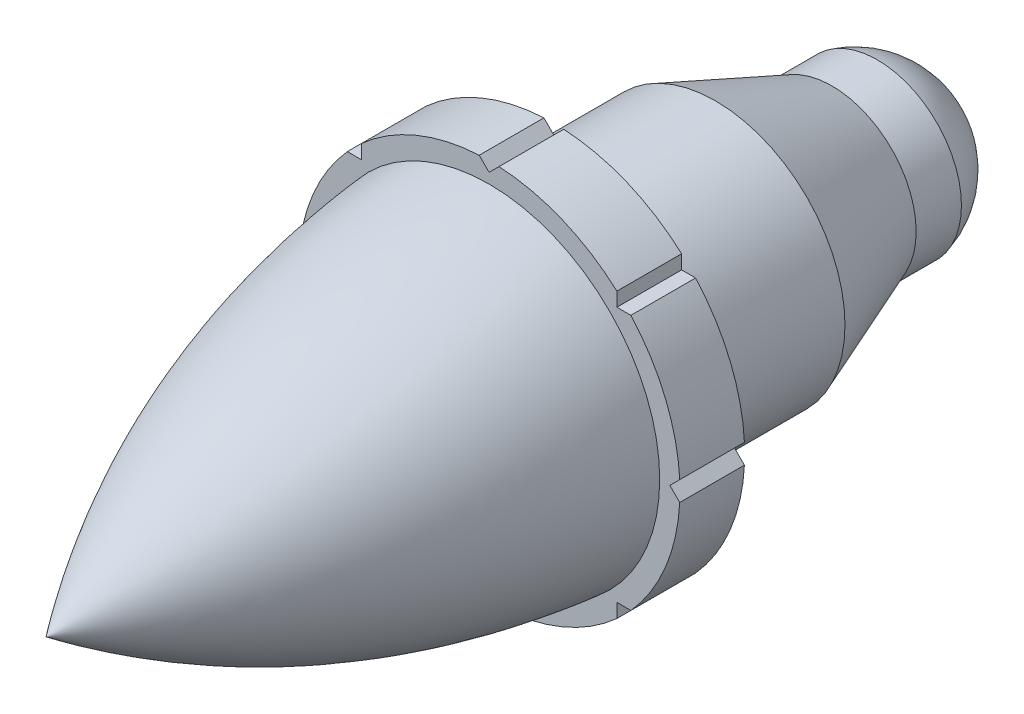
ISO-10303-21;
HEADER;
FILE_DESCRIPTION(('STEP AP214'),'2;1');
FILE_NAME('part.step','',(''),(''),'','','');
FILE_SCHEMA(('AUTOMOTIVE_DESIGN { 1 0 10303 214 1 1 1 1 }'));
ENDSEC;
DATA;
#1=APPLICATION_CONTEXT('core data for automotive mechanical design processes');
#2=APPLICATION_PROTOCOL_DEFINITION('international standard','automotive_design',2000,#1);
#3=PRODUCT_CONTEXT('',#1,'mechanical');
#4=PRODUCT('Part','Part','',(#3));
#5=PRODUCT_RELATED_PRODUCT_CATEGORY('part','',(#4));
#6=PRODUCT_DEFINITION_FORMATION('','',#4);
#7=PRODUCT_DEFINITION_CONTEXT('part definition',#1,'design');
#8=PRODUCT_DEFINITION('design','',#6,#7);
#9=PRODUCT_DEFINITION_SHAPE('','',#8);
#10=(LENGTH_UNIT() NAMED_UNIT(*) SI_UNIT(.MILLI.,.METRE.));
#11=(NAMED_UNIT(*) PLANE_ANGLE_UNIT() SI_UNIT($,.RADIAN.));
#12=(NAMED_UNIT(*) SI_UNIT($,.STERADIAN.) SOLID_ANGLE_UNIT());
#13=UNCERTAINTY_MEASURE_WITH_UNIT(LENGTH_MEASURE(1.E-05),#10,'distance_accuracy_value','');
#14=(GEOMETRIC_REPRESENTATION_CONTEXT(3) GLOBAL_UNCERTAINTY_ASSIGNED_CONTEXT((#13)) GLOBAL_UNIT_ASSIGNED_CONTEXT((#10,
#11,#12)) REPRESENTATION_CONTEXT('',''));
#15=CARTESIAN_POINT('',(0.,0.,0.));
#16=DIRECTION('',(0.,0.,1.));
#17=DIRECTION('',(1.,0.,0.));
#18=AXIS2_PLACEMENT_3D('',#15,#16,#17);
#19=CARTESIAN_POINT('',(0.,6.69709613872832,2.54));
#20=CARTESIAN_POINT('',(0.,5.7889272020502,12.0849471287564));
#21=CARTESIAN_POINT('',(0.,0.,19.9343193526012));
#22=B_SPLINE_CURVE_WITH_KNOTS('',2,(#19,#20,#21),.UNSPECIFIED.,.F.,.F.,(3,3),(0.,1.),.UNSPECIFIED.);
#23=CARTESIAN_POINT('',(0.,0.,-12.7));
#24=DIRECTION('',(0.,0.,-1.));
#25=AXIS1_PLACEMENT('',#23,#24);
#26=SURFACE_OF_REVOLUTION('',#22,#25);
#27=CARTESIAN_POINT('',(0.,0.,19.9343193526012));
#28=VERTEX_POINT('',#27);
#29=VERTEX_LOOP('',#28);
#30=FACE_BOUND('',#29,.T.);
#31=CARTESIAN_POINT('',(0.,0.,2.54));
#32=DIRECTION('',(0.,0.,-1.));
#33=DIRECTION('',(-1.,0.,0.));
#34=AXIS2_PLACEMENT_3D('',#31,#32,#33);
#35=CIRCLE('',#34,6.69709613872832);
#36=CARTESIAN_POINT('',(-6.69709613872832,0.,2.54));
#37=VERTEX_POINT('',#36);
#38=EDGE_CURVE('E13',#37,#37,#35,.T.);
#39=ORIENTED_EDGE('',*,*,#38,.F.);
#40=EDGE_LOOP('',(#39));
#41=FACE_BOUND('',#40,.T.);
#42=ADVANCED_FACE('F49',(#30,#41),#26,.F.);
#43=CARTESIAN_POINT('',(0.,0.,2.68153526011561));
#44=DIRECTION('',(0.,0.,-1.));
#45=DIRECTION('',(-1.,0.,0.));
#46=AXIS2_PLACEMENT_3D('',#43,#44,#45);
#47=CONICAL_SURFACE('',#46,0.,1.5496656470007);
#48=ORIENTED_EDGE('',*,*,#38,.T.);
#49=EDGE_LOOP('',(#48));
#50=FACE_BOUND('',#49,.T.);
#51=CARTESIAN_POINT('',(0.,0.,2.68153526011561));
#52=VERTEX_POINT('',#51);
#53=VERTEX_LOOP('',#52);
#54=FACE_BOUND('',#53,.T.);
#55=ADVANCED_FACE('F63',(#50,#54),#47,.F.);
#56=CLOSED_SHELL('',(#42,#55));
#57=MANIFOLD_SOLID_BREP('B2',#56);
#58=CARTESIAN_POINT('',(0.,0.,11.8860231660232));
#59=DIRECTION('',(0.,0.,1.));
#60=DIRECTION('',(1.,0.,0.));
#61=AXIS2_PLACEMENT_3D('',#58,#59,#60);
#62=CYLINDRICAL_SURFACE('',#61,7.493);
#63=CARTESIAN_POINT('',(0.,0.,2.54));
#64=DIRECTION('',(0.,0.,1.));
#65=DIRECTION('',(1.,0.,0.));
#66=AXIS2_PLACEMENT_3D('',#63,#64,#65);
#67=CIRCLE('',#66,7.493);
#68=CARTESIAN_POINT('',(-7.48295256577662,-0.387904496412491,2.54));
#69=VERTEX_POINT('',#68);
#70=CARTESIAN_POINT('',(-5.56553640242391,-5.01695660269195,2.54));
#71=VERTEX_POINT('',#70);
#72=EDGE_CURVE('E481',#69,#71,#67,.T.);
#73=ORIENTED_EDGE('',*,*,#72,.F.);
#74=DIRECTION('',(0.,0.,1.));
#75=VECTOR('',#74,1.);
#76=CARTESIAN_POINT('',(-7.48295256577662,-0.387904496412491,-15.24));
#77=LINE('',#76,#75);
#78=CARTESIAN_POINT('',(-7.48295256577662,-0.387904496412491,0.));
#79=VERTEX_POINT('',#78);
#80=EDGE_CURVE('E309',#79,#69,#77,.T.);
#81=ORIENTED_EDGE('',*,*,#80,.F.);
#82=CARTESIAN_POINT('',(0.,0.,0.));
#83=DIRECTION('',(0.,0.,1.));
#84=DIRECTION('',(1.,0.,0.));
#85=AXIS2_PLACEMENT_3D('',#82,#83,#84);
#86=CIRCLE('',#85,7.493);
#87=CARTESIAN_POINT('',(-5.56553640242391,-5.01695660269195,0.));
#88=VERTEX_POINT('',#87);
#89=EDGE_CURVE('E459',#79,#88,#86,.T.);
#90=ORIENTED_EDGE('',*,*,#89,.T.);
#91=DIRECTION('',(0.,0.,1.));
#92=VECTOR('',#91,1.);
#93=CARTESIAN_POINT('',(-5.56553640242391,-5.01695660269195,-15.24));
#94=LINE('',#93,#92);
#95=EDGE_CURVE('E323',#88,#71,#94,.T.);
#96=ORIENTED_EDGE('',*,*,#95,.T.);
#97=EDGE_LOOP('',(#73,#81,#90,#96));
#98=FACE_BOUND('',#97,.T.);
#99=ADVANCED_FACE('F91',(#98),#62,.T.);
#100=CARTESIAN_POINT('',(-5.01695660269189,-5.56553640242396,2.54));
#101=VERTEX_POINT('',#100);
#102=CARTESIAN_POINT('',(-0.387904496412464,-7.48295256577662,2.54));
#103=VERTEX_POINT('',#102);
#104=EDGE_CURVE('E482',#101,#103,#67,.T.);
#105=ORIENTED_EDGE('',*,*,#104,.F.);
#106=DIRECTION('',(0.,0.,1.));
#107=VECTOR('',#106,1.);
#108=CARTESIAN_POINT('',(-5.01695660269189,-5.56553640242396,-15.24));
#109=LINE('',#108,#107);
#110=CARTESIAN_POINT('',(-5.01695660269189,-5.56553640242396,0.));
#111=VERTEX_POINT('',#110);
#112=EDGE_CURVE('E329',#111,#101,#109,.T.);
#113=ORIENTED_EDGE('',*,*,#112,.F.);
#114=CARTESIAN_POINT('',(-0.387904496412466,-7.48295256577662,0.));
#115=VERTEX_POINT('',#114);
#116=EDGE_CURVE('E454',#111,#115,#86,.T.);
#117=ORIENTED_EDGE('',*,*,#116,.T.);
#118=DIRECTION('',(0.,0.,1.));
#119=VECTOR('',#118,1.);
#120=CARTESIAN_POINT('',(-0.387904496412464,-7.48295256577662,-15.24));
#121=LINE('',#120,#119);
#122=EDGE_CURVE('E341',#115,#103,#121,.T.);
#123=ORIENTED_EDGE('',*,*,#122,.T.);
#124=EDGE_LOOP('',(#105,#113,#117,#123));
#125=FACE_BOUND('',#124,.T.);
#126=ADVANCED_FACE('F512',(#125),#62,.T.);
#127=CARTESIAN_POINT('',(0.387904496412465,-7.48295256577663,2.54));
#128=VERTEX_POINT('',#127);
#129=CARTESIAN_POINT('',(5.01695660269197,-5.56553640242389,2.54));
#130=VERTEX_POINT('',#129);
#131=EDGE_CURVE('E485',#128,#130,#67,.T.);
#132=ORIENTED_EDGE('',*,*,#131,.F.);
#133=DIRECTION('',(0.,0.,1.));
#134=VECTOR('',#133,1.);
#135=CARTESIAN_POINT('',(0.387904496412465,-7.48295256577663,-15.24));
#136=LINE('',#135,#134);
#137=CARTESIAN_POINT('',(0.387904496412465,-7.48295256577663,0.));
#138=VERTEX_POINT('',#137);
#139=EDGE_CURVE('E347',#138,#128,#136,.T.);
#140=ORIENTED_EDGE('',*,*,#139,.F.);
#141=CARTESIAN_POINT('',(5.01695660269197,-5.56553640242389,0.));
#142=VERTEX_POINT('',#141);
#143=EDGE_CURVE('E449',#138,#142,#86,.T.);
#144=ORIENTED_EDGE('',*,*,#143,.T.);
#145=DIRECTION('',(0.,0.,1.));
#146=VECTOR('',#145,1.);
#147=CARTESIAN_POINT('',(5.01695660269197,-5.56553640242389,-15.24));
#148=LINE('',#147,#146);
#149=EDGE_CURVE('E357',#142,#130,#148,.T.);
#150=ORIENTED_EDGE('',*,*,#149,.T.);
#151=EDGE_LOOP('',(#132,#140,#144,#150));
#152=FACE_BOUND('',#151,.T.);
#153=ADVANCED_FACE('F518',(#152),#62,.T.);
#154=CARTESIAN_POINT('',(5.56553640242398,-5.01695660269187,2.54));
#155=VERTEX_POINT('',#154);
#156=CARTESIAN_POINT('',(7.48295256577663,-0.387904496412386,2.54));
#157=VERTEX_POINT('',#156);
#158=EDGE_CURVE('E275',#155,#157,#67,.T.);
#159=ORIENTED_EDGE('',*,*,#158,.F.);
#160=DIRECTION('',(0.,0.,1.));
#161=VECTOR('',#160,1.);
#162=CARTESIAN_POINT('',(5.56553640242398,-5.01695660269187,-15.24));
#163=LINE('',#162,#161);
#164=CARTESIAN_POINT('',(5.56553640242398,-5.01695660269187,0.));
#165=VERTEX_POINT('',#164);
#166=EDGE_CURVE('E363',#165,#155,#163,.T.);
#167=ORIENTED_EDGE('',*,*,#166,.F.);
#168=CARTESIAN_POINT('',(7.48295256577663,-0.387904496412387,0.));
#169=VERTEX_POINT('',#168);
#170=EDGE_CURVE('E445',#165,#169,#86,.T.);
#171=ORIENTED_EDGE('',*,*,#170,.T.);
#172=DIRECTION('',(0.,0.,1.));
#173=VECTOR('',#172,1.);
#174=CARTESIAN_POINT('',(7.48295256577663,-0.387904496412386,-15.24));
#175=LINE('',#174,#173);
#176=EDGE_CURVE('E114',#169,#157,#175,.T.);
#177=ORIENTED_EDGE('',*,*,#176,.T.);
#178=EDGE_LOOP('',(#159,#167,#171,#177));
#179=FACE_BOUND('',#178,.T.);
#180=ADVANCED_FACE('F534',(#179),#62,.T.);
#181=CARTESIAN_POINT('',(7.48295256577662,0.387904496412543,2.54));
#182=VERTEX_POINT('',#181);
#183=CARTESIAN_POINT('',(5.56553640242387,5.01695660269199,2.54));
#184=VERTEX_POINT('',#183);
#185=EDGE_CURVE('E493',#182,#184,#67,.T.);
#186=ORIENTED_EDGE('',*,*,#185,.F.);
#187=DIRECTION('',(0.,0.,1.));
#188=VECTOR('',#187,1.);
#189=CARTESIAN_POINT('',(7.48295256577662,0.387904496412543,-15.24));
#190=LINE('',#189,#188);
#191=CARTESIAN_POINT('',(7.48295256577662,0.387904496412543,0.));
#192=VERTEX_POINT('',#191);
#193=EDGE_CURVE('E264',#192,#182,#190,.T.);
#194=ORIENTED_EDGE('',*,*,#193,.F.);
#195=CARTESIAN_POINT('',(5.56553640242387,5.01695660269199,0.));
#196=VERTEX_POINT('',#195);
#197=EDGE_CURVE('E443',#192,#196,#86,.T.);
#198=ORIENTED_EDGE('',*,*,#197,.T.);
#199=DIRECTION('',(0.,0.,1.));
#200=VECTOR('',#199,1.);
#201=CARTESIAN_POINT('',(5.56553640242387,5.01695660269199,-15.24));
#202=LINE('',#201,#200);
#203=EDGE_CURVE('E106',#196,#184,#202,.T.);
#204=ORIENTED_EDGE('',*,*,#203,.T.);
#205=EDGE_LOOP('',(#186,#194,#198,#204));
#206=FACE_BOUND('',#205,.T.);
#207=ADVANCED_FACE('F495',(#206),#62,.T.);
#208=CARTESIAN_POINT('',(5.01695660269185,5.56553640242399,2.54));
#209=VERTEX_POINT('',#208);
#210=CARTESIAN_POINT('',(0.387904496412464,7.48295256577662,2.54));
#211=VERTEX_POINT('',#210);
#212=EDGE_CURVE('E414',#209,#211,#67,.T.);
#213=ORIENTED_EDGE('',*,*,#212,.F.);
#214=DIRECTION('',(0.,0.,1.));
#215=VECTOR('',#214,1.);
#216=CARTESIAN_POINT('',(5.01695660269185,5.56553640242399,-15.24));
#217=LINE('',#216,#215);
#218=CARTESIAN_POINT('',(5.01695660269185,5.56553640242399,0.));
#219=VERTEX_POINT('',#218);
#220=EDGE_CURVE('E294',#219,#209,#217,.T.);
#221=ORIENTED_EDGE('',*,*,#220,.F.);
#222=CARTESIAN_POINT('',(0.387904496412465,7.48295256577663,0.));
#223=VERTEX_POINT('',#222);
#224=EDGE_CURVE('E410',#219,#223,#86,.T.);
#225=ORIENTED_EDGE('',*,*,#224,.T.);
#226=DIRECTION('',(0.,0.,1.));
#227=VECTOR('',#226,1.);
#228=CARTESIAN_POINT('',(0.387904496412464,7.48295256577662,-15.24));
#229=LINE('',#228,#227);
#230=EDGE_CURVE('E397',#223,#211,#229,.T.);
#231=ORIENTED_EDGE('',*,*,#230,.T.);
#232=EDGE_LOOP('',(#213,#221,#225,#231));
#233=FACE_BOUND('',#232,.T.);
#234=ADVANCED_FACE('F441',(#233),#62,.T.);
#235=CARTESIAN_POINT('',(-5.56553640242394,5.01695660269191,0.));
#236=VERTEX_POINT('',#235);
#237=CARTESIAN_POINT('',(-7.48295256577663,0.38790449641244,0.));
#238=VERTEX_POINT('',#237);
#239=EDGE_CURVE('E415',#236,#238,#86,.T.);
#240=ORIENTED_EDGE('',*,*,#239,.T.);
#241=DIRECTION('',(0.,0.,1.));
#242=VECTOR('',#241,1.);
#243=CARTESIAN_POINT('',(-7.48295256577663,0.387904496412438,-15.24));
#244=LINE('',#243,#242);
#245=CARTESIAN_POINT('',(-7.48295256577663,0.387904496412438,2.54));
#246=VERTEX_POINT('',#245);
#247=EDGE_CURVE('E303',#238,#246,#244,.T.);
#248=ORIENTED_EDGE('',*,*,#247,.T.);
#249=CARTESIAN_POINT('',(-5.56553640242394,5.01695660269191,2.54));
#250=VERTEX_POINT('',#249);
#251=EDGE_CURVE('E419',#250,#246,#67,.T.);
#252=ORIENTED_EDGE('',*,*,#251,.F.);
#253=DIRECTION('',(0.,0.,1.));
#254=VECTOR('',#253,1.);
#255=CARTESIAN_POINT('',(-5.56553640242394,5.01695660269191,-15.24));
#256=LINE('',#255,#254);
#257=EDGE_CURVE('E379',#236,#250,#256,.T.);
#258=ORIENTED_EDGE('',*,*,#257,.F.);
#259=EDGE_LOOP('',(#240,#248,#252,#258));
#260=FACE_BOUND('',#259,.T.);
#261=ADVANCED_FACE('F470',(#260),#62,.T.);
#262=CARTESIAN_POINT('',(0.,0.,2.54));
#263=DIRECTION('',(0.,0.,-1.));
#264=DIRECTION('',(-1.,0.,0.));
#265=AXIS2_PLACEMENT_3D('',#262,#263,#264);
#266=PLANE('',#265);
#267=DIRECTION('',(-0.70710678118655,0.707106781186545,0.));
#268=VECTOR('',#267,1.);
#269=CARTESIAN_POINT('',(-7.09504806936416,0.,2.54));
#270=LINE('',#269,#268);
#271=CARTESIAN_POINT('',(-7.09504806936416,0.,2.54));
#272=VERTEX_POINT('',#271);
#273=EDGE_CURVE('E298',#272,#246,#270,.T.);
#274=ORIENTED_EDGE('',*,*,#273,.F.);
#275=DIRECTION('',(0.707106781186545,0.70710678118655,0.));
#276=VECTOR('',#275,1.);
#277=CARTESIAN_POINT('',(-7.09504806936416,0.,2.54));
#278=LINE('',#277,#276);
#279=EDGE_CURVE('E311',#69,#272,#278,.T.);
#280=ORIENTED_EDGE('',*,*,#279,.F.);
#281=ORIENTED_EDGE('',*,*,#72,.T.);
#282=DIRECTION('',(-1.,0.,0.));
#283=VECTOR('',#282,1.);
#284=CARTESIAN_POINT('',(-5.01695660269189,-5.01695660269195,2.54));
#285=LINE('',#284,#283);
#286=CARTESIAN_POINT('',(-5.01695660269189,-5.01695660269195,2.54));
#287=VERTEX_POINT('',#286);
#288=EDGE_CURVE('E318',#287,#71,#285,.T.);
#289=ORIENTED_EDGE('',*,*,#288,.F.);
#290=DIRECTION('',(0.,1.,0.));
#291=VECTOR('',#290,1.);
#292=CARTESIAN_POINT('',(-5.01695660269189,-5.01695660269195,2.54));
#293=LINE('',#292,#291);
#294=EDGE_CURVE('E331',#101,#287,#293,.T.);
#295=ORIENTED_EDGE('',*,*,#294,.F.);
#296=ORIENTED_EDGE('',*,*,#104,.T.);
#297=DIRECTION('',(-0.707106781186548,-0.707106781186547,0.));
#298=VECTOR('',#297,1.);
#299=CARTESIAN_POINT('',(0.,-7.09504806936416,2.54));
#300=LINE('',#299,#298);
#301=CARTESIAN_POINT('',(0.,-7.09504806936416,2.54));
#302=VERTEX_POINT('',#301);
#303=EDGE_CURVE('E336',#302,#103,#300,.T.);
#304=ORIENTED_EDGE('',*,*,#303,.F.);
#305=DIRECTION('',(-0.707106781186548,0.707106781186547,0.));
#306=VECTOR('',#305,1.);
#307=CARTESIAN_POINT('',(0.,-7.09504806936416,2.54));
#308=LINE('',#307,#306);
#309=EDGE_CURVE('E349',#128,#302,#308,.T.);
#310=ORIENTED_EDGE('',*,*,#309,.F.);
#311=ORIENTED_EDGE('',*,*,#131,.T.);
#312=DIRECTION('',(0.,-1.,0.));
#313=VECTOR('',#312,1.);
#314=CARTESIAN_POINT('',(5.01695660269196,-5.01695660269188,2.54));
#315=LINE('',#314,#313);
#316=CARTESIAN_POINT('',(5.01695660269196,-5.01695660269188,2.54));
#317=VERTEX_POINT('',#316);
#318=EDGE_CURVE('E286',#317,#130,#315,.T.);
#319=ORIENTED_EDGE('',*,*,#318,.F.);
#320=DIRECTION('',(-1.,0.,0.));
#321=VECTOR('',#320,1.);
#322=CARTESIAN_POINT('',(5.01695660269196,-5.01695660269188,2.54));
#323=LINE('',#322,#321);
#324=EDGE_CURVE('E365',#155,#317,#323,.T.);
#325=ORIENTED_EDGE('',*,*,#324,.F.);
#326=ORIENTED_EDGE('',*,*,#158,.T.);
#327=DIRECTION('',(0.707106781186555,-0.70710678118654,0.));
#328=VECTOR('',#327,1.);
#329=CARTESIAN_POINT('',(7.09504806936416,0.,2.54));
#330=LINE('',#329,#328);
#331=CARTESIAN_POINT('',(7.09504806936416,0.,2.54));
#332=VERTEX_POINT('',#331);
#333=EDGE_CURVE('E255',#332,#157,#330,.T.);
#334=ORIENTED_EDGE('',*,*,#333,.F.);
#335=DIRECTION('',(-0.70710678118654,-0.707106781186555,0.));
#336=VECTOR('',#335,1.);
#337=CARTESIAN_POINT('',(7.09504806936416,0.,2.54));
#338=LINE('',#337,#336);
#339=EDGE_CURVE('E261',#182,#332,#338,.T.);
#340=ORIENTED_EDGE('',*,*,#339,.F.);
#341=ORIENTED_EDGE('',*,*,#185,.T.);
#342=DIRECTION('',(1.,0.,0.));
#343=VECTOR('',#342,1.);
#344=CARTESIAN_POINT('',(5.01695660269186,5.01695660269198,2.54));
#345=LINE('',#344,#343);
#346=CARTESIAN_POINT('',(5.01695660269186,5.01695660269198,2.54));
#347=VERTEX_POINT('',#346);
#348=EDGE_CURVE('E287',#347,#184,#345,.T.);
#349=ORIENTED_EDGE('',*,*,#348,.F.);
#350=DIRECTION('',(0.,-1.,0.));
#351=VECTOR('',#350,1.);
#352=CARTESIAN_POINT('',(5.01695660269186,5.01695660269198,2.54));
#353=LINE('',#352,#351);
#354=EDGE_CURVE('E279',#209,#347,#353,.T.);
#355=ORIENTED_EDGE('',*,*,#354,.F.);
#356=ORIENTED_EDGE('',*,*,#212,.T.);
#357=DIRECTION('',(0.707106781186548,0.707106781186547,0.));
#358=VECTOR('',#357,1.);
#359=CARTESIAN_POINT('',(0.,7.09504806936416,2.54));
#360=LINE('',#359,#358);
#361=CARTESIAN_POINT('',(0.,7.09504806936416,2.54));
#362=VERTEX_POINT('',#361);
#363=EDGE_CURVE('E390',#362,#211,#360,.T.);
#364=ORIENTED_EDGE('',*,*,#363,.F.);
#365=DIRECTION('',(0.707106781186548,-0.707106781186547,0.));
#366=VECTOR('',#365,1.);
#367=CARTESIAN_POINT('',(0.,7.09504806936416,2.54));
#368=LINE('',#367,#366);
#369=CARTESIAN_POINT('',(-0.387904496412465,7.48295256577663,2.54));
#370=VERTEX_POINT('',#369);
#371=EDGE_CURVE('E387',#370,#362,#368,.T.);
#372=ORIENTED_EDGE('',*,*,#371,.F.);
#373=CARTESIAN_POINT('',(-5.01695660269193,5.56553640242392,2.54));
#374=VERTEX_POINT('',#373);
#375=EDGE_CURVE('E416',#370,#374,#67,.T.);
#376=ORIENTED_EDGE('',*,*,#375,.T.);
#377=DIRECTION('',(0.,1.,0.));
#378=VECTOR('',#377,1.);
#379=CARTESIAN_POINT('',(-5.01695660269193,5.01695660269191,2.54));
#380=LINE('',#379,#378);
#381=CARTESIAN_POINT('',(-5.01695660269193,5.01695660269191,2.54));
#382=VERTEX_POINT('',#381);
#383=EDGE_CURVE('E317',#382,#374,#380,.T.);
#384=ORIENTED_EDGE('',*,*,#383,.F.);
#385=DIRECTION('',(1.,0.,0.));
#386=VECTOR('',#385,1.);
#387=CARTESIAN_POINT('',(-5.01695660269193,5.01695660269191,2.54));
#388=LINE('',#387,#386);
#389=EDGE_CURVE('E381',#250,#382,#388,.T.);
#390=ORIENTED_EDGE('',*,*,#389,.F.);
#391=ORIENTED_EDGE('',*,*,#251,.T.);
#392=EDGE_LOOP('',(#274,#280,#281,#289,#295,#296,#304,#310,#311,#319,#325,#326,#334,#340,#341,
#349,#355,#356,#364,#372,#376,#384,#390,#391));
#393=FACE_BOUND('',#392,.T.);
#394=ADVANCED_FACE('F272',(#393),#266,.F.);
#395=CARTESIAN_POINT('',(-0.387904496412465,7.48295256577663,0.));
#396=VERTEX_POINT('',#395);
#397=CARTESIAN_POINT('',(-5.01695660269193,5.56553640242393,0.));
#398=VERTEX_POINT('',#397);
#399=EDGE_CURVE('E411',#396,#398,#86,.T.);
#400=ORIENTED_EDGE('',*,*,#399,.T.);
#401=DIRECTION('',(0.,0.,1.));
#402=VECTOR('',#401,1.);
#403=CARTESIAN_POINT('',(-5.01695660269193,5.56553640242392,-15.24));
#404=LINE('',#403,#402);
#405=EDGE_CURVE('E373',#398,#374,#404,.T.);
#406=ORIENTED_EDGE('',*,*,#405,.T.);
#407=ORIENTED_EDGE('',*,*,#375,.F.);
#408=DIRECTION('',(0.,0.,1.));
#409=VECTOR('',#408,1.);
#410=CARTESIAN_POINT('',(-0.387904496412465,7.48295256577663,-15.24));
#411=LINE('',#410,#409);
#412=EDGE_CURVE('E394',#396,#370,#411,.T.);
#413=ORIENTED_EDGE('',*,*,#412,.F.);
#414=EDGE_LOOP('',(#400,#406,#407,#413));
#415=FACE_BOUND('',#414,.T.);
#416=ADVANCED_FACE('F514',(#415),#62,.T.);
#417=CARTESIAN_POINT('',(0.,7.493,0.));
#418=DIRECTION('',(0.,0.,1.));
#419=DIRECTION('',(1.,0.,0.));
#420=AXIS2_PLACEMENT_3D('',#417,#418,#419);
#421=PLANE('',#420);
#422=ORIENTED_EDGE('',*,*,#89,.F.);
#423=DIRECTION('',(0.707106781186545,0.70710678118655,0.));
#424=VECTOR('',#423,1.);
#425=CARTESIAN_POINT('',(-7.29402403468208,-0.198975965317945,0.));
#426=LINE('',#425,#424);
#427=CARTESIAN_POINT('',(-7.09504806936416,0.,0.));
#428=VERTEX_POINT('',#427);
#429=EDGE_CURVE('E314',#79,#428,#426,.T.);
#430=ORIENTED_EDGE('',*,*,#429,.T.);
#431=DIRECTION('',(-0.70710678118655,0.707106781186545,0.));
#432=VECTOR('',#431,1.);
#433=CARTESIAN_POINT('',(-7.29402403468208,0.198975965317894,0.));
#434=LINE('',#433,#432);
#435=EDGE_CURVE('E306',#428,#238,#434,.T.);
#436=ORIENTED_EDGE('',*,*,#435,.T.);
#437=ORIENTED_EDGE('',*,*,#239,.F.);
#438=DIRECTION('',(1.,0.,0.));
#439=VECTOR('',#438,1.);
#440=CARTESIAN_POINT('',(-5.29835111143081,5.01695660269191,0.));
#441=LINE('',#440,#439);
#442=CARTESIAN_POINT('',(-5.01695660269193,5.01695660269191,0.));
#443=VERTEX_POINT('',#442);
#444=EDGE_CURVE('E384',#236,#443,#441,.T.);
#445=ORIENTED_EDGE('',*,*,#444,.T.);
#446=DIRECTION('',(0.,1.,0.));
#447=VECTOR('',#446,1.);
#448=CARTESIAN_POINT('',(-5.01695660269193,5.29835111143079,0.));
#449=LINE('',#448,#447);
#450=EDGE_CURVE('E376',#443,#398,#449,.T.);
#451=ORIENTED_EDGE('',*,*,#450,.T.);
#452=ORIENTED_EDGE('',*,*,#399,.F.);
#453=DIRECTION('',(0.707106781186548,-0.707106781186547,0.));
#454=VECTOR('',#453,1.);
#455=CARTESIAN_POINT('',(-0.198975965317919,7.29402403468208,0.));
#456=LINE('',#455,#454);
#457=CARTESIAN_POINT('',(0.,7.09504806936416,0.));
#458=VERTEX_POINT('',#457);
#459=EDGE_CURVE('E47',#396,#458,#456,.T.);
#460=ORIENTED_EDGE('',*,*,#459,.T.);
#461=DIRECTION('',(0.707106781186548,0.707106781186547,0.));
#462=VECTOR('',#461,1.);
#463=CARTESIAN_POINT('',(0.198975965317919,7.29402403468208,0.));
#464=LINE('',#463,#462);
#465=EDGE_CURVE('E99',#458,#223,#464,.T.);
#466=ORIENTED_EDGE('',*,*,#465,.T.);
#467=ORIENTED_EDGE('',*,*,#224,.F.);
#468=DIRECTION('',(0.,-1.,0.));
#469=VECTOR('',#468,1.);
#470=CARTESIAN_POINT('',(5.01695660269186,5.29835111143086,0.));
#471=LINE('',#470,#469);
#472=CARTESIAN_POINT('',(5.01695660269186,5.01695660269198,0.));
#473=VERTEX_POINT('',#472);
#474=EDGE_CURVE('E276',#219,#473,#471,.T.);
#475=ORIENTED_EDGE('',*,*,#474,.T.);
#476=DIRECTION('',(1.,0.,0.));
#477=VECTOR('',#476,1.);
#478=CARTESIAN_POINT('',(5.29835111143074,5.01695660269198,0.));
#479=LINE('',#478,#477);
#480=EDGE_CURVE('E292',#473,#196,#479,.T.);
#481=ORIENTED_EDGE('',*,*,#480,.T.);
#482=ORIENTED_EDGE('',*,*,#197,.F.);
#483=DIRECTION('',(-0.70710678118654,-0.707106781186555,0.));
#484=VECTOR('',#483,1.);
#485=CARTESIAN_POINT('',(7.29402403468208,0.198975965317996,0.));
#486=LINE('',#485,#484);
#487=CARTESIAN_POINT('',(7.09504806936416,0.,0.));
#488=VERTEX_POINT('',#487);
#489=EDGE_CURVE('E268',#192,#488,#486,.T.);
#490=ORIENTED_EDGE('',*,*,#489,.T.);
#491=DIRECTION('',(0.707106781186555,-0.70710678118654,0.));
#492=VECTOR('',#491,1.);
#493=CARTESIAN_POINT('',(7.29402403468208,-0.198975965317843,0.));
#494=LINE('',#493,#492);
#495=EDGE_CURVE('E256',#488,#169,#494,.T.);
#496=ORIENTED_EDGE('',*,*,#495,.T.);
#497=ORIENTED_EDGE('',*,*,#170,.F.);
#498=DIRECTION('',(-1.,0.,0.));
#499=VECTOR('',#498,1.);
#500=CARTESIAN_POINT('',(5.29835111143084,-5.01695660269187,0.));
#501=LINE('',#500,#499);
#502=CARTESIAN_POINT('',(5.01695660269196,-5.01695660269188,0.));
#503=VERTEX_POINT('',#502);
#504=EDGE_CURVE('E339',#165,#503,#501,.T.);
#505=ORIENTED_EDGE('',*,*,#504,.T.);
#506=DIRECTION('',(0.,-1.,0.));
#507=VECTOR('',#506,1.);
#508=CARTESIAN_POINT('',(5.01695660269197,-5.29835111143076,0.));
#509=LINE('',#508,#507);
#510=EDGE_CURVE('E360',#503,#142,#509,.T.);
#511=ORIENTED_EDGE('',*,*,#510,.T.);
#512=ORIENTED_EDGE('',*,*,#143,.F.);
#513=DIRECTION('',(-0.707106781186548,0.707106781186547,0.));
#514=VECTOR('',#513,1.);
#515=CARTESIAN_POINT('',(0.198975965317919,-7.29402403468208,0.));
#516=LINE('',#515,#514);
#517=CARTESIAN_POINT('',(0.,-7.09504806936416,0.));
#518=VERTEX_POINT('',#517);
#519=EDGE_CURVE('E321',#138,#518,#516,.T.);
#520=ORIENTED_EDGE('',*,*,#519,.T.);
#521=DIRECTION('',(-0.707106781186548,-0.707106781186547,0.));
#522=VECTOR('',#521,1.);
#523=CARTESIAN_POINT('',(-0.198975965317919,-7.29402403468208,0.));
#524=LINE('',#523,#522);
#525=EDGE_CURVE('E344',#518,#115,#524,.T.);
#526=ORIENTED_EDGE('',*,*,#525,.T.);
#527=ORIENTED_EDGE('',*,*,#116,.F.);
#528=DIRECTION('',(0.,1.,0.));
#529=VECTOR('',#528,1.);
#530=CARTESIAN_POINT('',(-5.01695660269189,-5.29835111143083,0.));
#531=LINE('',#530,#529);
#532=CARTESIAN_POINT('',(-5.01695660269189,-5.01695660269195,0.));
#533=VERTEX_POINT('',#532);
#534=EDGE_CURVE('E301',#111,#533,#531,.T.);
#535=ORIENTED_EDGE('',*,*,#534,.T.);
#536=DIRECTION('',(-1.,0.,0.));
#537=VECTOR('',#536,1.);
#538=CARTESIAN_POINT('',(-5.29835111143077,-5.01695660269195,0.));
#539=LINE('',#538,#537);
#540=EDGE_CURVE('E326',#533,#88,#539,.T.);
#541=ORIENTED_EDGE('',*,*,#540,.T.);
#542=EDGE_LOOP('',(#422,#430,#436,#437,#445,#451,#452,#460,#466,#467,#475,#481,#482,#490,#496,
#497,#505,#511,#512,#520,#526,#527,#535,#541));
#543=FACE_BOUND('',#542,.T.);
#544=CARTESIAN_POINT('',(0.,0.,0.));
#545=DIRECTION('',(0.,0.,1.));
#546=DIRECTION('',(1.,0.,0.));
#547=AXIS2_PLACEMENT_3D('',#544,#545,#546);
#548=CIRCLE('',#547,5.08);
#549=CARTESIAN_POINT('',(5.08,0.,0.));
#550=VERTEX_POINT('',#549);
#551=EDGE_CURVE('E407',#550,#550,#548,.T.);
#552=ORIENTED_EDGE('',*,*,#551,.T.);
#553=EDGE_LOOP('',(#552));
#554=FACE_BOUND('',#553,.T.);
#555=ADVANCED_FACE('F425',(#543,#554),#421,.F.);
#556=CARTESIAN_POINT('',(0.,0.,11.8860231660232));
#557=DIRECTION('',(0.,0.,1.));
#558=DIRECTION('',(1.,0.,0.));
#559=AXIS2_PLACEMENT_3D('',#556,#557,#558);
#560=CYLINDRICAL_SURFACE('',#559,5.08);
#561=CARTESIAN_POINT('',(0.,0.,-6.35));
#562=DIRECTION('',(0.,0.,1.));
#563=DIRECTION('',(1.,0.,0.));
#564=AXIS2_PLACEMENT_3D('',#561,#562,#563);
#565=CIRCLE('',#564,5.08);
#566=CARTESIAN_POINT('',(5.08,0.,-6.35));
#567=VERTEX_POINT('',#566);
#568=EDGE_CURVE('E401',#567,#567,#565,.T.);
#569=ORIENTED_EDGE('',*,*,#568,.T.);
#570=EDGE_LOOP('',(#569));
#571=FACE_BOUND('',#570,.T.);
#572=ORIENTED_EDGE('',*,*,#551,.F.);
#573=EDGE_LOOP('',(#572));
#574=FACE_BOUND('',#573,.T.);
#575=ADVANCED_FACE('F526',(#571,#574),#560,.T.);
#576=CARTESIAN_POINT('',(0.,0.,23.0525574340242));
#577=DIRECTION('',(0.,0.,1.));
#578=DIRECTION('',(1.,0.,0.));
#579=AXIS2_PLACEMENT_3D('',#576,#577,#578);
#580=CYLINDRICAL_SURFACE('',#579,3.302);
#581=CARTESIAN_POINT('',(0.,0.,-12.7));
#582=DIRECTION('',(0.,0.,1.));
#583=DIRECTION('',(1.,0.,0.));
#584=AXIS2_PLACEMENT_3D('',#581,#582,#583);
#585=CIRCLE('',#584,3.302);
#586=CARTESIAN_POINT('',(3.302,0.,-12.7));
#587=VERTEX_POINT('',#586);
#588=EDGE_CURVE('E396',#587,#587,#585,.T.);
#589=ORIENTED_EDGE('',*,*,#588,.T.);
#590=EDGE_LOOP('',(#589));
#591=FACE_BOUND('',#590,.T.);
#592=CARTESIAN_POINT('',(0.,0.,-10.922));
#593=DIRECTION('',(0.,0.,1.));
#594=DIRECTION('',(1.,0.,0.));
#595=AXIS2_PLACEMENT_3D('',#592,#593,#594);
#596=CIRCLE('',#595,3.302);
#597=CARTESIAN_POINT('',(3.302,0.,-10.922));
#598=VERTEX_POINT('',#597);
#599=EDGE_CURVE('E404',#598,#598,#596,.T.);
#600=ORIENTED_EDGE('',*,*,#599,.F.);
#601=EDGE_LOOP('',(#600));
#602=FACE_BOUND('',#601,.T.);
#603=ADVANCED_FACE('F586',(#591,#602),#580,.T.);
#604=CARTESIAN_POINT('',(0.,0.,-6.35));
#605=DIRECTION('',(0.,0.,1.));
#606=DIRECTION('',(1.,0.,0.));
#607=AXIS2_PLACEMENT_3D('',#604,#605,#606);
#608=CONICAL_SURFACE('',#607,5.08,0.370891288812663);
#609=ORIENTED_EDGE('',*,*,#599,.T.);
#610=EDGE_LOOP('',(#609));
#611=FACE_BOUND('',#610,.T.);
#612=ORIENTED_EDGE('',*,*,#568,.F.);
#613=EDGE_LOOP('',(#612));
#614=FACE_BOUND('',#613,.T.);
#615=ADVANCED_FACE('F583',(#611,#614),#608,.T.);
#616=CARTESIAN_POINT('',(0.,0.,-11.8237));
#617=DIRECTION('',(0.,0.,1.));
#618=DIRECTION('',(1.,0.,0.));
#619=AXIS2_PLACEMENT_3D('',#616,#617,#618);
#620=SPHERICAL_SURFACE('',#619,3.4163);
#621=ORIENTED_EDGE('',*,*,#588,.F.);
#622=EDGE_LOOP('',(#621));
#623=FACE_BOUND('',#622,.T.);
#624=ADVANCED_FACE('F93',(#623),#620,.T.);
#625=CARTESIAN_POINT('',(0.,7.09504806936416,-15.24));
#626=DIRECTION('',(-0.707106781186547,-0.707106781186548,0.));
#627=DIRECTION('',(0.707106781186548,-0.707106781186547,0.));
#628=AXIS2_PLACEMENT_3D('',#625,#626,#627);
#629=PLANE('',#628);
#630=ORIENTED_EDGE('',*,*,#412,.T.);
#631=ORIENTED_EDGE('',*,*,#371,.T.);
#632=DIRECTION('',(0.,0.,1.));
#633=VECTOR('',#632,1.);
#634=CARTESIAN_POINT('',(0.,7.09504806936416,-15.24));
#635=LINE('',#634,#633);
#636=EDGE_CURVE('E393',#458,#362,#635,.T.);
#637=ORIENTED_EDGE('',*,*,#636,.F.);
#638=ORIENTED_EDGE('',*,*,#459,.F.);
#639=EDGE_LOOP('',(#630,#631,#637,#638));
#640=FACE_BOUND('',#639,.T.);
#641=ADVANCED_FACE('F433',(#640),#629,.F.);
#642=CARTESIAN_POINT('',(0.,7.09504806936416,-15.24));
#643=DIRECTION('',(0.707106781186547,-0.707106781186548,0.));
#644=DIRECTION('',(0.707106781186548,0.707106781186547,0.));
#645=AXIS2_PLACEMENT_3D('',#642,#643,#644);
#646=PLANE('',#645);
#647=ORIENTED_EDGE('',*,*,#636,.T.);
#648=ORIENTED_EDGE('',*,*,#363,.T.);
#649=ORIENTED_EDGE('',*,*,#230,.F.);
#650=ORIENTED_EDGE('',*,*,#465,.F.);
#651=EDGE_LOOP('',(#647,#648,#649,#650));
#652=FACE_BOUND('',#651,.T.);
#653=ADVANCED_FACE('F431',(#652),#646,.F.);
#654=CARTESIAN_POINT('',(-5.01695660269193,5.01695660269191,-15.24));
#655=DIRECTION('',(0.,-1.,0.));
#656=DIRECTION('',(1.,0.,0.));
#657=AXIS2_PLACEMENT_3D('',#654,#655,#656);
#658=PLANE('',#657);
#659=ORIENTED_EDGE('',*,*,#257,.T.);
#660=ORIENTED_EDGE('',*,*,#389,.T.);
#661=DIRECTION('',(0.,0.,1.));
#662=VECTOR('',#661,1.);
#663=CARTESIAN_POINT('',(-5.01695660269193,5.01695660269191,-15.24));
#664=LINE('',#663,#662);
#665=EDGE_CURVE('E371',#443,#382,#664,.T.);
#666=ORIENTED_EDGE('',*,*,#665,.F.);
#667=ORIENTED_EDGE('',*,*,#444,.F.);
#668=EDGE_LOOP('',(#659,#660,#666,#667));
#669=FACE_BOUND('',#668,.T.);
#670=ADVANCED_FACE('F507',(#669),#658,.F.);
#671=CARTESIAN_POINT('',(-5.01695660269193,5.01695660269191,-15.24));
#672=DIRECTION('',(1.,0.,0.));
#673=DIRECTION('',(0.,1.,0.));
#674=AXIS2_PLACEMENT_3D('',#671,#672,#673);
#675=PLANE('',#674);
#676=ORIENTED_EDGE('',*,*,#665,.T.);
#677=ORIENTED_EDGE('',*,*,#383,.T.);
#678=ORIENTED_EDGE('',*,*,#405,.F.);
#679=ORIENTED_EDGE('',*,*,#450,.F.);
#680=EDGE_LOOP('',(#676,#677,#678,#679));
#681=FACE_BOUND('',#680,.T.);
#682=ADVANCED_FACE('F500',(#681),#675,.F.);
#683=CARTESIAN_POINT('',(5.01695660269186,5.01695660269198,-15.24));
#684=DIRECTION('',(-1.,0.,0.));
#685=DIRECTION('',(0.,-1.,0.));
#686=AXIS2_PLACEMENT_3D('',#683,#684,#685);
#687=PLANE('',#686);
#688=ORIENTED_EDGE('',*,*,#220,.T.);
#689=ORIENTED_EDGE('',*,*,#354,.T.);
#690=DIRECTION('',(0.,0.,1.));
#691=VECTOR('',#690,1.);
#692=CARTESIAN_POINT('',(5.01695660269186,5.01695660269198,-15.24));
#693=LINE('',#692,#691);
#694=EDGE_CURVE('E289',#473,#347,#693,.T.);
#695=ORIENTED_EDGE('',*,*,#694,.F.);
#696=ORIENTED_EDGE('',*,*,#474,.F.);
#697=EDGE_LOOP('',(#688,#689,#695,#696));
#698=FACE_BOUND('',#697,.T.);
#699=ADVANCED_FACE('F498',(#698),#687,.F.);
#700=CARTESIAN_POINT('',(5.01695660269186,5.01695660269198,-15.24));
#701=DIRECTION('',(0.,-1.,0.));
#702=DIRECTION('',(1.,0.,0.));
#703=AXIS2_PLACEMENT_3D('',#700,#701,#702);
#704=PLANE('',#703);
#705=ORIENTED_EDGE('',*,*,#694,.T.);
#706=ORIENTED_EDGE('',*,*,#348,.T.);
#707=ORIENTED_EDGE('',*,*,#203,.F.);
#708=ORIENTED_EDGE('',*,*,#480,.F.);
#709=EDGE_LOOP('',(#705,#706,#707,#708));
#710=FACE_BOUND('',#709,.T.);
#711=ADVANCED_FACE('F496',(#710),#704,.F.);
#712=CARTESIAN_POINT('',(7.09504806936416,0.,-15.24));
#713=DIRECTION('',(-0.707106781186555,0.70710678118654,0.));
#714=DIRECTION('',(-0.70710678118654,-0.707106781186555,0.));
#715=AXIS2_PLACEMENT_3D('',#712,#713,#714);
#716=PLANE('',#715);
#717=ORIENTED_EDGE('',*,*,#193,.T.);
#718=ORIENTED_EDGE('',*,*,#339,.T.);
#719=DIRECTION('',(0.,0.,1.));
#720=VECTOR('',#719,1.);
#721=CARTESIAN_POINT('',(7.09504806936416,0.,-15.24));
#722=LINE('',#721,#720);
#723=EDGE_CURVE('E251',#488,#332,#722,.T.);
#724=ORIENTED_EDGE('',*,*,#723,.F.);
#725=ORIENTED_EDGE('',*,*,#489,.F.);
#726=EDGE_LOOP('',(#717,#718,#724,#725));
#727=FACE_BOUND('',#726,.T.);
#728=ADVANCED_FACE('F262',(#727),#716,.F.);
#729=CARTESIAN_POINT('',(7.09504806936416,0.,-15.24));
#730=DIRECTION('',(-0.70710678118654,-0.707106781186554,0.));
#731=DIRECTION('',(0.707106781186555,-0.70710678118654,0.));
#732=AXIS2_PLACEMENT_3D('',#729,#730,#731);
#733=PLANE('',#732);
#734=ORIENTED_EDGE('',*,*,#723,.T.);
#735=ORIENTED_EDGE('',*,*,#333,.T.);
#736=ORIENTED_EDGE('',*,*,#176,.F.);
#737=ORIENTED_EDGE('',*,*,#495,.F.);
#738=EDGE_LOOP('',(#734,#735,#736,#737));
#739=FACE_BOUND('',#738,.T.);
#740=ADVANCED_FACE('F253',(#739),#733,.F.);
#741=CARTESIAN_POINT('',(5.01695660269196,-5.01695660269188,-15.24));
#742=DIRECTION('',(0.,1.,0.));
#743=DIRECTION('',(-1.,0.,0.));
#744=AXIS2_PLACEMENT_3D('',#741,#742,#743);
#745=PLANE('',#744);
#746=ORIENTED_EDGE('',*,*,#166,.T.);
#747=ORIENTED_EDGE('',*,*,#324,.T.);
#748=DIRECTION('',(0.,0.,1.));
#749=VECTOR('',#748,1.);
#750=CARTESIAN_POINT('',(5.01695660269196,-5.01695660269188,-15.24));
#751=LINE('',#750,#749);
#752=EDGE_CURVE('E355',#503,#317,#751,.T.);
#753=ORIENTED_EDGE('',*,*,#752,.F.);
#754=ORIENTED_EDGE('',*,*,#504,.F.);
#755=EDGE_LOOP('',(#746,#747,#753,#754));
#756=FACE_BOUND('',#755,.T.);
#757=ADVANCED_FACE('F543',(#756),#745,.F.);
#758=CARTESIAN_POINT('',(5.01695660269196,-5.01695660269188,-15.24));
#759=DIRECTION('',(-1.,0.,0.));
#760=DIRECTION('',(0.,-1.,0.));
#761=AXIS2_PLACEMENT_3D('',#758,#759,#760);
#762=PLANE('',#761);
#763=ORIENTED_EDGE('',*,*,#752,.T.);
#764=ORIENTED_EDGE('',*,*,#318,.T.);
#765=ORIENTED_EDGE('',*,*,#149,.F.);
#766=ORIENTED_EDGE('',*,*,#510,.F.);
#767=EDGE_LOOP('',(#763,#764,#765,#766));
#768=FACE_BOUND('',#767,.T.);
#769=ADVANCED_FACE('F545',(#768),#762,.F.);
#770=CARTESIAN_POINT('',(0.,-7.09504806936416,-15.24));
#771=DIRECTION('',(0.707106781186547,0.707106781186548,0.));
#772=DIRECTION('',(-0.707106781186548,0.707106781186547,0.));
#773=AXIS2_PLACEMENT_3D('',#770,#771,#772);
#774=PLANE('',#773);
#775=ORIENTED_EDGE('',*,*,#139,.T.);
#776=ORIENTED_EDGE('',*,*,#309,.T.);
#777=DIRECTION('',(0.,0.,1.));
#778=VECTOR('',#777,1.);
#779=CARTESIAN_POINT('',(0.,-7.09504806936416,-15.24));
#780=LINE('',#779,#778);
#781=EDGE_CURVE('E338',#518,#302,#780,.T.);
#782=ORIENTED_EDGE('',*,*,#781,.F.);
#783=ORIENTED_EDGE('',*,*,#519,.F.);
#784=EDGE_LOOP('',(#775,#776,#782,#783));
#785=FACE_BOUND('',#784,.T.);
#786=ADVANCED_FACE('F548',(#785),#774,.F.);
#787=CARTESIAN_POINT('',(0.,-7.09504806936416,-15.24));
#788=DIRECTION('',(-0.707106781186547,0.707106781186548,0.));
#789=DIRECTION('',(-0.707106781186548,-0.707106781186547,0.));
#790=AXIS2_PLACEMENT_3D('',#787,#788,#789);
#791=PLANE('',#790);
#792=ORIENTED_EDGE('',*,*,#781,.T.);
#793=ORIENTED_EDGE('',*,*,#303,.T.);
#794=ORIENTED_EDGE('',*,*,#122,.F.);
#795=ORIENTED_EDGE('',*,*,#525,.F.);
#796=EDGE_LOOP('',(#792,#793,#794,#795));
#797=FACE_BOUND('',#796,.T.);
#798=ADVANCED_FACE('F550',(#797),#791,.F.);
#799=CARTESIAN_POINT('',(-5.01695660269189,-5.01695660269195,-15.24));
#800=DIRECTION('',(1.,0.,0.));
#801=DIRECTION('',(0.,1.,0.));
#802=AXIS2_PLACEMENT_3D('',#799,#800,#801);
#803=PLANE('',#802);
#804=ORIENTED_EDGE('',*,*,#112,.T.);
#805=ORIENTED_EDGE('',*,*,#294,.T.);
#806=DIRECTION('',(0.,0.,1.));
#807=VECTOR('',#806,1.);
#808=CARTESIAN_POINT('',(-5.01695660269189,-5.01695660269195,-15.24));
#809=LINE('',#808,#807);
#810=EDGE_CURVE('E320',#533,#287,#809,.T.);
#811=ORIENTED_EDGE('',*,*,#810,.F.);
#812=ORIENTED_EDGE('',*,*,#534,.F.);
#813=EDGE_LOOP('',(#804,#805,#811,#812));
#814=FACE_BOUND('',#813,.T.);
#815=ADVANCED_FACE('F553',(#814),#803,.F.);
#816=CARTESIAN_POINT('',(-5.01695660269189,-5.01695660269195,-15.24));
#817=DIRECTION('',(0.,1.,0.));
#818=DIRECTION('',(-1.,0.,0.));
#819=AXIS2_PLACEMENT_3D('',#816,#817,#818);
#820=PLANE('',#819);
#821=ORIENTED_EDGE('',*,*,#810,.T.);
#822=ORIENTED_EDGE('',*,*,#288,.T.);
#823=ORIENTED_EDGE('',*,*,#95,.F.);
#824=ORIENTED_EDGE('',*,*,#540,.F.);
#825=EDGE_LOOP('',(#821,#822,#823,#824));
#826=FACE_BOUND('',#825,.T.);
#827=ADVANCED_FACE('F555',(#826),#820,.F.);
#828=CARTESIAN_POINT('',(-7.09504806936416,0.,-15.24));
#829=DIRECTION('',(0.70710678118655,-0.707106781186545,0.));
#830=DIRECTION('',(0.707106781186545,0.70710678118655,0.));
#831=AXIS2_PLACEMENT_3D('',#828,#829,#830);
#832=PLANE('',#831);
#833=ORIENTED_EDGE('',*,*,#80,.T.);
#834=ORIENTED_EDGE('',*,*,#279,.T.);
#835=DIRECTION('',(0.,0.,1.));
#836=VECTOR('',#835,1.);
#837=CARTESIAN_POINT('',(-7.09504806936416,0.,-15.24));
#838=LINE('',#837,#836);
#839=EDGE_CURVE('E300',#428,#272,#838,.T.);
#840=ORIENTED_EDGE('',*,*,#839,.F.);
#841=ORIENTED_EDGE('',*,*,#429,.F.);
#842=EDGE_LOOP('',(#833,#834,#840,#841));
#843=FACE_BOUND('',#842,.T.);
#844=ADVANCED_FACE('F557',(#843),#832,.F.);
#845=CARTESIAN_POINT('',(-7.09504806936416,0.,-15.24));
#846=DIRECTION('',(0.707106781186545,0.707106781186549,0.));
#847=DIRECTION('',(-0.70710678118655,0.707106781186545,0.));
#848=AXIS2_PLACEMENT_3D('',#845,#846,#847);
#849=PLANE('',#848);
#850=ORIENTED_EDGE('',*,*,#839,.T.);
#851=ORIENTED_EDGE('',*,*,#273,.T.);
#852=ORIENTED_EDGE('',*,*,#247,.F.);
#853=ORIENTED_EDGE('',*,*,#435,.F.);
#854=EDGE_LOOP('',(#850,#851,#852,#853));
#855=FACE_BOUND('',#854,.T.);
#856=ADVANCED_FACE('F475',(#855),#849,.F.);
#857=CLOSED_SHELL('',(#99,#126,#153,#180,#207,#234,#261,#394,#416,#555,#575,#603,#615,#624,#641,
#653,#670,#682,#699,#711,#728,#740,#757,#769,#786,#798,#815,#827,#844,#856));
#858=MANIFOLD_SOLID_BREP('B7',#857);
#859=ADVANCED_BREP_SHAPE_REPRESENTATION('',(#18,#57,#858),#14);
#860=SHAPE_DEFINITION_REPRESENTATION(#9,#859);
ENDSEC;
END-ISO-10303-21;
